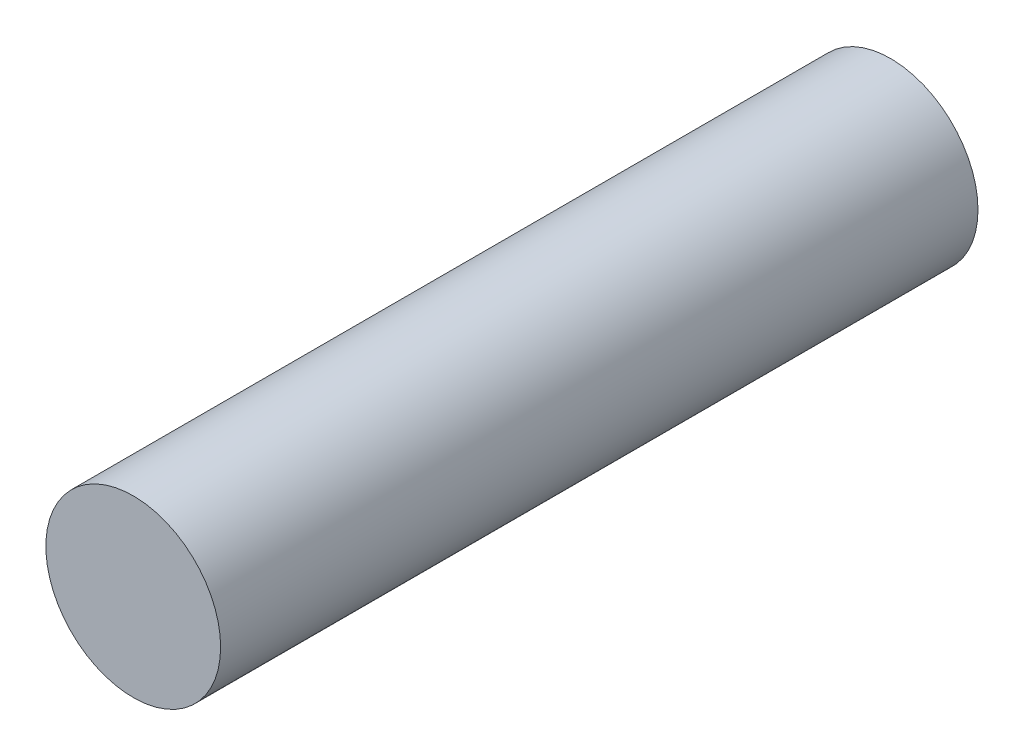
ISO-10303-21;
HEADER;
FILE_DESCRIPTION(('STEP AP214'),'2;1');
FILE_NAME('part.step','',(''),(''),'','','');
FILE_SCHEMA(('AUTOMOTIVE_DESIGN { 1 0 10303 214 1 1 1 1 }'));
ENDSEC;
DATA;
#1=APPLICATION_CONTEXT('core data for automotive mechanical design processes');
#2=APPLICATION_PROTOCOL_DEFINITION('international standard','automotive_design',2000,#1);
#3=PRODUCT_CONTEXT('',#1,'mechanical');
#4=PRODUCT('Part','Part','',(#3));
#5=PRODUCT_RELATED_PRODUCT_CATEGORY('part','',(#4));
#6=PRODUCT_DEFINITION_FORMATION('','',#4);
#7=PRODUCT_DEFINITION_CONTEXT('part definition',#1,'design');
#8=PRODUCT_DEFINITION('design','',#6,#7);
#9=PRODUCT_DEFINITION_SHAPE('','',#8);
#10=(LENGTH_UNIT() NAMED_UNIT(*) SI_UNIT(.MILLI.,.METRE.));
#11=(NAMED_UNIT(*) PLANE_ANGLE_UNIT() SI_UNIT($,.RADIAN.));
#12=(NAMED_UNIT(*) SI_UNIT($,.STERADIAN.) SOLID_ANGLE_UNIT());
#13=UNCERTAINTY_MEASURE_WITH_UNIT(LENGTH_MEASURE(1.E-05),#10,'distance_accuracy_value','');
#14=(GEOMETRIC_REPRESENTATION_CONTEXT(3) GLOBAL_UNCERTAINTY_ASSIGNED_CONTEXT((#13)) GLOBAL_UNIT_ASSIGNED_CONTEXT((#10,
#11,#12)) REPRESENTATION_CONTEXT('',''));
#15=CARTESIAN_POINT('',(0.,0.,0.));
#16=DIRECTION('',(0.,0.,1.));
#17=DIRECTION('',(1.,0.,0.));
#18=AXIS2_PLACEMENT_3D('',#15,#16,#17);
#19=CARTESIAN_POINT('',(0.,0.,20.6375));
#20=DIRECTION('',(0.,0.,-1.));
#21=DIRECTION('',(-1.,0.,0.));
#22=AXIS2_PLACEMENT_3D('',#19,#20,#21);
#23=PLANE('',#22);
#24=CARTESIAN_POINT('',(0.,0.,20.6375));
#25=DIRECTION('',(0.,0.,1.));
#26=DIRECTION('',(1.,0.,0.));
#27=AXIS2_PLACEMENT_3D('',#24,#25,#26);
#28=CIRCLE('',#27,2.38125);
#29=CARTESIAN_POINT('',(2.38125,0.,20.6375));
#30=VERTEX_POINT('',#29);
#31=EDGE_CURVE('E18',#30,#30,#28,.F.);
#32=ORIENTED_EDGE('',*,*,#31,.F.);
#33=EDGE_LOOP('',(#32));
#34=FACE_BOUND('',#33,.T.);
#35=ADVANCED_FACE('F15',(#34),#23,.F.);
#36=CARTESIAN_POINT('',(0.,0.,0.));
#37=DIRECTION('',(0.,0.,-1.));
#38=DIRECTION('',(-1.,0.,0.));
#39=AXIS2_PLACEMENT_3D('',#36,#37,#38);
#40=PLANE('',#39);
#41=CARTESIAN_POINT('',(0.,0.,0.));
#42=DIRECTION('',(0.,0.,1.));
#43=DIRECTION('',(1.,0.,0.));
#44=AXIS2_PLACEMENT_3D('',#41,#42,#43);
#45=CIRCLE('',#44,2.38125);
#46=CARTESIAN_POINT('',(2.38125,0.,0.));
#47=VERTEX_POINT('',#46);
#48=EDGE_CURVE('E10',#47,#47,#45,.T.);
#49=ORIENTED_EDGE('',*,*,#48,.F.);
#50=EDGE_LOOP('',(#49));
#51=FACE_BOUND('',#50,.T.);
#52=ADVANCED_FACE('F30',(#51),#40,.T.);
#53=CARTESIAN_POINT('',(0.,0.,0.));
#54=DIRECTION('',(0.,0.,1.));
#55=DIRECTION('',(1.,0.,0.));
#56=AXIS2_PLACEMENT_3D('',#53,#54,#55);
#57=CYLINDRICAL_SURFACE('',#56,2.38125);
#58=ORIENTED_EDGE('',*,*,#48,.T.);
#59=EDGE_LOOP('',(#58));
#60=FACE_BOUND('',#59,.T.);
#61=ORIENTED_EDGE('',*,*,#31,.T.);
#62=EDGE_LOOP('',(#61));
#63=FACE_BOUND('',#62,.T.);
#64=ADVANCED_FACE('F27',(#60,#63),#57,.T.);
#65=CLOSED_SHELL('',(#35,#52,#64));
#66=MANIFOLD_SOLID_BREP('B1',#65);
#67=ADVANCED_BREP_SHAPE_REPRESENTATION('',(#18,#66),#14);
#68=SHAPE_DEFINITION_REPRESENTATION(#9,#67);
ENDSEC;
END-ISO-10303-21;
